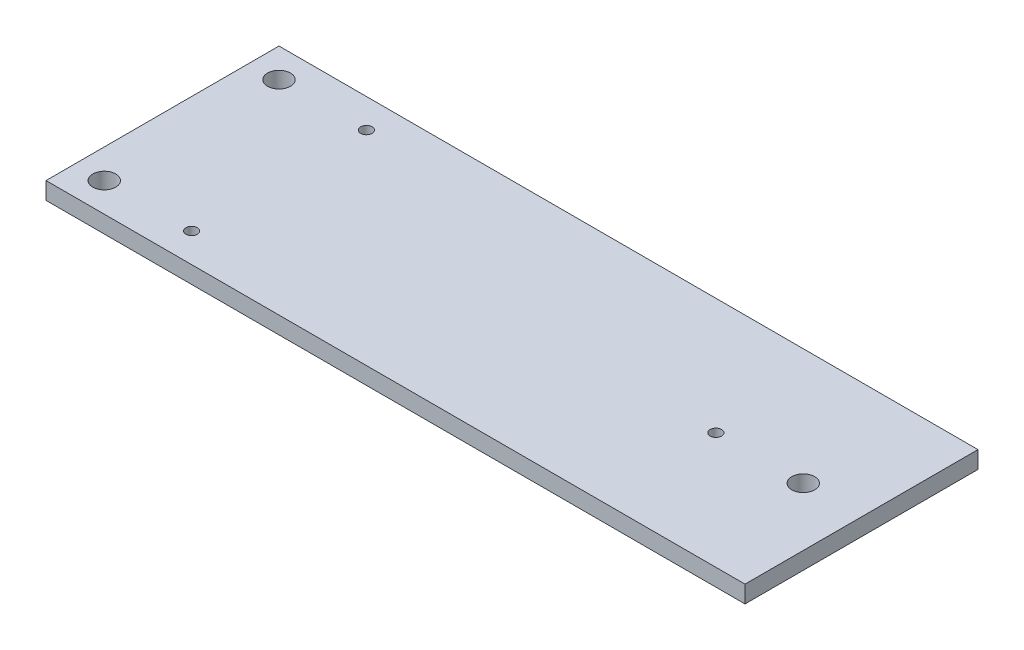
ISO-10303-21;
HEADER;
FILE_DESCRIPTION(('STEP AP214'),'2;1');
FILE_NAME('part.step','',(''),(''),'','','');
FILE_SCHEMA(('AUTOMOTIVE_DESIGN { 1 0 10303 214 1 1 1 1 }'));
ENDSEC;
DATA;
#1=APPLICATION_CONTEXT('core data for automotive mechanical design processes');
#2=APPLICATION_PROTOCOL_DEFINITION('international standard','automotive_design',2000,#1);
#3=PRODUCT_CONTEXT('',#1,'mechanical');
#4=PRODUCT('Part','Part','',(#3));
#5=PRODUCT_RELATED_PRODUCT_CATEGORY('part','',(#4));
#6=PRODUCT_DEFINITION_FORMATION('','',#4);
#7=PRODUCT_DEFINITION_CONTEXT('part definition',#1,'design');
#8=PRODUCT_DEFINITION('design','',#6,#7);
#9=PRODUCT_DEFINITION_SHAPE('','',#8);
#10=(LENGTH_UNIT() NAMED_UNIT(*) SI_UNIT(.MILLI.,.METRE.));
#11=(NAMED_UNIT(*) PLANE_ANGLE_UNIT() SI_UNIT($,.RADIAN.));
#12=(NAMED_UNIT(*) SI_UNIT($,.STERADIAN.) SOLID_ANGLE_UNIT());
#13=UNCERTAINTY_MEASURE_WITH_UNIT(LENGTH_MEASURE(1.E-05),#10,'distance_accuracy_value','');
#14=(GEOMETRIC_REPRESENTATION_CONTEXT(3) GLOBAL_UNCERTAINTY_ASSIGNED_CONTEXT((#13)) GLOBAL_UNIT_ASSIGNED_CONTEXT((#10,
#11,#12)) REPRESENTATION_CONTEXT('',''));
#15=CARTESIAN_POINT('',(0.,0.,0.));
#16=DIRECTION('',(0.,0.,1.));
#17=DIRECTION('',(1.,0.,0.));
#18=AXIS2_PLACEMENT_3D('',#15,#16,#17);
#19=CARTESIAN_POINT('',(0.,1.5,0.));
#20=DIRECTION('',(0.,-1.,0.));
#21=DIRECTION('',(0.,0.,-1.));
#22=AXIS2_PLACEMENT_3D('',#19,#20,#21);
#23=PLANE('',#22);
#24=CARTESIAN_POINT('',(48.26,1.5,-10.16));
#25=DIRECTION('',(0.,1.,0.));
#26=DIRECTION('',(0.,0.,1.));
#27=AXIS2_PLACEMENT_3D('',#24,#25,#26);
#28=CIRCLE('',#27,0.499999999999999);
#29=CARTESIAN_POINT('',(48.26,1.5,-9.66));
#30=VERTEX_POINT('',#29);
#31=EDGE_CURVE('E133',#30,#30,#28,.T.);
#32=ORIENTED_EDGE('',*,*,#31,.F.);
#33=EDGE_LOOP('',(#32));
#34=FACE_BOUND('',#33,.T.);
#35=CARTESIAN_POINT('',(2.54,1.5,-17.78));
#36=DIRECTION('',(0.,1.,0.));
#37=DIRECTION('',(0.,0.,-1.));
#38=AXIS2_PLACEMENT_3D('',#35,#36,#37);
#39=CIRCLE('',#38,0.999999999999999);
#40=CARTESIAN_POINT('',(2.54,1.5,-18.78));
#41=VERTEX_POINT('',#40);
#42=EDGE_CURVE('E121',#41,#41,#39,.T.);
#43=ORIENTED_EDGE('',*,*,#42,.F.);
#44=EDGE_LOOP('',(#43));
#45=FACE_BOUND('',#44,.T.);
#46=CARTESIAN_POINT('',(2.54,1.5,-2.54));
#47=DIRECTION('',(0.,1.,0.));
#48=DIRECTION('',(0.,0.,1.));
#49=AXIS2_PLACEMENT_3D('',#46,#47,#48);
#50=CIRCLE('',#49,1.);
#51=CARTESIAN_POINT('',(2.54,1.5,-1.54));
#52=VERTEX_POINT('',#51);
#53=EDGE_CURVE('E100',#52,#52,#50,.T.);
#54=ORIENTED_EDGE('',*,*,#53,.F.);
#55=EDGE_LOOP('',(#54));
#56=FACE_BOUND('',#55,.T.);
#57=DIRECTION('',(0.,0.,1.));
#58=VECTOR('',#57,1.);
#59=CARTESIAN_POINT('',(0.,1.5,0.));
#60=LINE('',#59,#58);
#61=CARTESIAN_POINT('',(0.,1.5,-20.32));
#62=VERTEX_POINT('',#61);
#63=CARTESIAN_POINT('',(0.,1.5,0.));
#64=VERTEX_POINT('',#63);
#65=EDGE_CURVE('E85',#62,#64,#60,.T.);
#66=ORIENTED_EDGE('',*,*,#65,.T.);
#67=DIRECTION('',(1.,0.,0.));
#68=VECTOR('',#67,1.);
#69=CARTESIAN_POINT('',(0.,1.5,0.));
#70=LINE('',#69,#68);
#71=CARTESIAN_POINT('',(60.96,1.5,0.));
#72=VERTEX_POINT('',#71);
#73=EDGE_CURVE('E80',#64,#72,#70,.T.);
#74=ORIENTED_EDGE('',*,*,#73,.T.);
#75=DIRECTION('',(0.,0.,-1.));
#76=VECTOR('',#75,1.);
#77=CARTESIAN_POINT('',(60.96,1.5,0.));
#78=LINE('',#77,#76);
#79=CARTESIAN_POINT('',(60.96,1.5,-20.32));
#80=VERTEX_POINT('',#79);
#81=EDGE_CURVE('E83',#72,#80,#78,.T.);
#82=ORIENTED_EDGE('',*,*,#81,.T.);
#83=DIRECTION('',(-1.,0.,0.));
#84=VECTOR('',#83,1.);
#85=CARTESIAN_POINT('',(0.,1.5,-20.32));
#86=LINE('',#85,#84);
#87=EDGE_CURVE('E50',#80,#62,#86,.T.);
#88=ORIENTED_EDGE('',*,*,#87,.T.);
#89=EDGE_LOOP('',(#66,#74,#82,#88));
#90=FACE_BOUND('',#89,.T.);
#91=CARTESIAN_POINT('',(55.88,1.5,-10.16));
#92=DIRECTION('',(0.,1.,0.));
#93=DIRECTION('',(0.,0.,1.));
#94=AXIS2_PLACEMENT_3D('',#91,#92,#93);
#95=CIRCLE('',#94,0.999999999999998);
#96=CARTESIAN_POINT('',(55.88,1.5,-9.16));
#97=VERTEX_POINT('',#96);
#98=EDGE_CURVE('E115',#97,#97,#95,.T.);
#99=ORIENTED_EDGE('',*,*,#98,.F.);
#100=EDGE_LOOP('',(#99));
#101=FACE_BOUND('',#100,.T.);
#102=CARTESIAN_POINT('',(10.16,1.5,-2.54));
#103=DIRECTION('',(0.,1.,0.));
#104=DIRECTION('',(0.,0.,1.));
#105=AXIS2_PLACEMENT_3D('',#102,#103,#104);
#106=CIRCLE('',#105,0.500000000000001);
#107=CARTESIAN_POINT('',(10.16,1.5,-2.04));
#108=VERTEX_POINT('',#107);
#109=EDGE_CURVE('E127',#108,#108,#106,.T.);
#110=ORIENTED_EDGE('',*,*,#109,.F.);
#111=EDGE_LOOP('',(#110));
#112=FACE_BOUND('',#111,.T.);
#113=CARTESIAN_POINT('',(10.16,1.5,-17.78));
#114=DIRECTION('',(0.,1.,0.));
#115=DIRECTION('',(0.,0.,-1.));
#116=AXIS2_PLACEMENT_3D('',#113,#114,#115);
#117=CIRCLE('',#116,0.500000000000001);
#118=CARTESIAN_POINT('',(10.16,1.5,-18.28));
#119=VERTEX_POINT('',#118);
#120=EDGE_CURVE('E139',#119,#119,#117,.T.);
#121=ORIENTED_EDGE('',*,*,#120,.F.);
#122=EDGE_LOOP('',(#121));
#123=FACE_BOUND('',#122,.T.);
#124=ADVANCED_FACE('F33',(#34,#45,#56,#90,#101,#112,#123),#23,.F.);
#125=CARTESIAN_POINT('',(0.,0.,0.));
#126=DIRECTION('',(0.,-1.,0.));
#127=DIRECTION('',(0.,0.,-1.));
#128=AXIS2_PLACEMENT_3D('',#125,#126,#127);
#129=PLANE('',#128);
#130=CARTESIAN_POINT('',(48.26,0.,-10.16));
#131=DIRECTION('',(0.,1.,0.));
#132=DIRECTION('',(0.,0.,1.));
#133=AXIS2_PLACEMENT_3D('',#130,#131,#132);
#134=CIRCLE('',#133,0.499999999999999);
#135=CARTESIAN_POINT('',(48.26,0.,-9.66));
#136=VERTEX_POINT('',#135);
#137=EDGE_CURVE('E136',#136,#136,#134,.T.);
#138=ORIENTED_EDGE('',*,*,#137,.T.);
#139=EDGE_LOOP('',(#138));
#140=FACE_BOUND('',#139,.T.);
#141=CARTESIAN_POINT('',(2.54,0.,-17.78));
#142=DIRECTION('',(0.,1.,0.));
#143=DIRECTION('',(0.,0.,-1.));
#144=AXIS2_PLACEMENT_3D('',#141,#142,#143);
#145=CIRCLE('',#144,0.999999999999999);
#146=CARTESIAN_POINT('',(2.54,0.,-18.78));
#147=VERTEX_POINT('',#146);
#148=EDGE_CURVE('E124',#147,#147,#145,.T.);
#149=ORIENTED_EDGE('',*,*,#148,.T.);
#150=EDGE_LOOP('',(#149));
#151=FACE_BOUND('',#150,.T.);
#152=CARTESIAN_POINT('',(2.54,0.,-2.54));
#153=DIRECTION('',(0.,1.,0.));
#154=DIRECTION('',(0.,0.,1.));
#155=AXIS2_PLACEMENT_3D('',#152,#153,#154);
#156=CIRCLE('',#155,1.);
#157=CARTESIAN_POINT('',(2.54,0.,-1.54));
#158=VERTEX_POINT('',#157);
#159=EDGE_CURVE('E112',#158,#158,#156,.T.);
#160=ORIENTED_EDGE('',*,*,#159,.T.);
#161=EDGE_LOOP('',(#160));
#162=FACE_BOUND('',#161,.T.);
#163=DIRECTION('',(0.,0.,1.));
#164=VECTOR('',#163,1.);
#165=CARTESIAN_POINT('',(0.,0.,0.));
#166=LINE('',#165,#164);
#167=CARTESIAN_POINT('',(0.,0.,-20.32));
#168=VERTEX_POINT('',#167);
#169=CARTESIAN_POINT('',(0.,0.,0.));
#170=VERTEX_POINT('',#169);
#171=EDGE_CURVE('E97',#168,#170,#166,.T.);
#172=ORIENTED_EDGE('',*,*,#171,.F.);
#173=DIRECTION('',(-1.,0.,0.));
#174=VECTOR('',#173,1.);
#175=CARTESIAN_POINT('',(0.,0.,-20.32));
#176=LINE('',#175,#174);
#177=CARTESIAN_POINT('',(60.96,0.,-20.32));
#178=VERTEX_POINT('',#177);
#179=EDGE_CURVE('E73',#178,#168,#176,.T.);
#180=ORIENTED_EDGE('',*,*,#179,.F.);
#181=DIRECTION('',(0.,0.,-1.));
#182=VECTOR('',#181,1.);
#183=CARTESIAN_POINT('',(60.96,0.,0.));
#184=LINE('',#183,#182);
#185=CARTESIAN_POINT('',(60.96,0.,0.));
#186=VERTEX_POINT('',#185);
#187=EDGE_CURVE('E67',#186,#178,#184,.T.);
#188=ORIENTED_EDGE('',*,*,#187,.F.);
#189=DIRECTION('',(1.,0.,0.));
#190=VECTOR('',#189,1.);
#191=CARTESIAN_POINT('',(0.,0.,0.));
#192=LINE('',#191,#190);
#193=EDGE_CURVE('E89',#170,#186,#192,.T.);
#194=ORIENTED_EDGE('',*,*,#193,.F.);
#195=EDGE_LOOP('',(#172,#180,#188,#194));
#196=FACE_BOUND('',#195,.T.);
#197=CARTESIAN_POINT('',(55.88,0.,-10.16));
#198=DIRECTION('',(0.,1.,0.));
#199=DIRECTION('',(0.,0.,1.));
#200=AXIS2_PLACEMENT_3D('',#197,#198,#199);
#201=CIRCLE('',#200,0.999999999999998);
#202=CARTESIAN_POINT('',(55.88,0.,-9.16));
#203=VERTEX_POINT('',#202);
#204=EDGE_CURVE('E118',#203,#203,#201,.T.);
#205=ORIENTED_EDGE('',*,*,#204,.T.);
#206=EDGE_LOOP('',(#205));
#207=FACE_BOUND('',#206,.T.);
#208=CARTESIAN_POINT('',(10.16,0.,-2.54));
#209=DIRECTION('',(0.,1.,0.));
#210=DIRECTION('',(0.,0.,1.));
#211=AXIS2_PLACEMENT_3D('',#208,#209,#210);
#212=CIRCLE('',#211,0.500000000000001);
#213=CARTESIAN_POINT('',(10.16,0.,-2.04));
#214=VERTEX_POINT('',#213);
#215=EDGE_CURVE('E130',#214,#214,#212,.T.);
#216=ORIENTED_EDGE('',*,*,#215,.T.);
#217=EDGE_LOOP('',(#216));
#218=FACE_BOUND('',#217,.T.);
#219=CARTESIAN_POINT('',(10.16,0.,-17.78));
#220=DIRECTION('',(0.,1.,0.));
#221=DIRECTION('',(0.,0.,-1.));
#222=AXIS2_PLACEMENT_3D('',#219,#220,#221);
#223=CIRCLE('',#222,0.500000000000001);
#224=CARTESIAN_POINT('',(10.16,0.,-18.28));
#225=VERTEX_POINT('',#224);
#226=EDGE_CURVE('E142',#225,#225,#223,.T.);
#227=ORIENTED_EDGE('',*,*,#226,.T.);
#228=EDGE_LOOP('',(#227));
#229=FACE_BOUND('',#228,.T.);
#230=ADVANCED_FACE('F108',(#140,#151,#162,#196,#207,#218,#229),#129,.T.);
#231=CARTESIAN_POINT('',(0.,1.5,0.));
#232=DIRECTION('',(1.,0.,0.));
#233=DIRECTION('',(0.,0.,-1.));
#234=AXIS2_PLACEMENT_3D('',#231,#232,#233);
#235=PLANE('',#234);
#236=ORIENTED_EDGE('',*,*,#171,.T.);
#237=DIRECTION('',(0.,-1.,0.));
#238=VECTOR('',#237,1.);
#239=CARTESIAN_POINT('',(0.,1.5,0.));
#240=LINE('',#239,#238);
#241=EDGE_CURVE('E11',#64,#170,#240,.T.);
#242=ORIENTED_EDGE('',*,*,#241,.F.);
#243=ORIENTED_EDGE('',*,*,#65,.F.);
#244=DIRECTION('',(0.,-1.,0.));
#245=VECTOR('',#244,1.);
#246=CARTESIAN_POINT('',(0.,1.5,-20.32));
#247=LINE('',#246,#245);
#248=EDGE_CURVE('E93',#62,#168,#247,.T.);
#249=ORIENTED_EDGE('',*,*,#248,.T.);
#250=EDGE_LOOP('',(#236,#242,#243,#249));
#251=FACE_BOUND('',#250,.T.);
#252=ADVANCED_FACE('F35',(#251),#235,.F.);
#253=CARTESIAN_POINT('',(0.,1.5,0.));
#254=DIRECTION('',(0.,0.,-1.));
#255=DIRECTION('',(-1.,0.,0.));
#256=AXIS2_PLACEMENT_3D('',#253,#254,#255);
#257=PLANE('',#256);
#258=ORIENTED_EDGE('',*,*,#193,.T.);
#259=DIRECTION('',(0.,-1.,0.));
#260=VECTOR('',#259,1.);
#261=CARTESIAN_POINT('',(60.96,1.5,0.));
#262=LINE('',#261,#260);
#263=EDGE_CURVE('E42',#72,#186,#262,.T.);
#264=ORIENTED_EDGE('',*,*,#263,.F.);
#265=ORIENTED_EDGE('',*,*,#73,.F.);
#266=ORIENTED_EDGE('',*,*,#241,.T.);
#267=EDGE_LOOP('',(#258,#264,#265,#266));
#268=FACE_BOUND('',#267,.T.);
#269=ADVANCED_FACE('F88',(#268),#257,.F.);
#270=CARTESIAN_POINT('',(60.96,1.5,0.));
#271=DIRECTION('',(-1.,0.,0.));
#272=DIRECTION('',(0.,0.,1.));
#273=AXIS2_PLACEMENT_3D('',#270,#271,#272);
#274=PLANE('',#273);
#275=ORIENTED_EDGE('',*,*,#187,.T.);
#276=DIRECTION('',(0.,-1.,0.));
#277=VECTOR('',#276,1.);
#278=CARTESIAN_POINT('',(60.96,1.5,-20.32));
#279=LINE('',#278,#277);
#280=EDGE_CURVE('E90',#80,#178,#279,.T.);
#281=ORIENTED_EDGE('',*,*,#280,.F.);
#282=ORIENTED_EDGE('',*,*,#81,.F.);
#283=ORIENTED_EDGE('',*,*,#263,.T.);
#284=EDGE_LOOP('',(#275,#281,#282,#283));
#285=FACE_BOUND('',#284,.T.);
#286=ADVANCED_FACE('F91',(#285),#274,.F.);
#287=CARTESIAN_POINT('',(0.,1.5,-20.32));
#288=DIRECTION('',(0.,0.,1.));
#289=DIRECTION('',(1.,0.,0.));
#290=AXIS2_PLACEMENT_3D('',#287,#288,#289);
#291=PLANE('',#290);
#292=ORIENTED_EDGE('',*,*,#179,.T.);
#293=ORIENTED_EDGE('',*,*,#248,.F.);
#294=ORIENTED_EDGE('',*,*,#87,.F.);
#295=ORIENTED_EDGE('',*,*,#280,.T.);
#296=EDGE_LOOP('',(#292,#293,#294,#295));
#297=FACE_BOUND('',#296,.T.);
#298=ADVANCED_FACE('F105',(#297),#291,.F.);
#299=CARTESIAN_POINT('',(2.54,1.5,-2.54));
#300=DIRECTION('',(0.,-1.,0.));
#301=DIRECTION('',(0.,0.,-1.));
#302=AXIS2_PLACEMENT_3D('',#299,#300,#301);
#303=CYLINDRICAL_SURFACE('',#302,1.);
#304=ORIENTED_EDGE('',*,*,#53,.T.);
#305=EDGE_LOOP('',(#304));
#306=FACE_BOUND('',#305,.T.);
#307=ORIENTED_EDGE('',*,*,#159,.F.);
#308=EDGE_LOOP('',(#307));
#309=FACE_BOUND('',#308,.T.);
#310=ADVANCED_FACE('F162',(#306,#309),#303,.F.);
#311=CARTESIAN_POINT('',(55.88,1.5,-10.16));
#312=DIRECTION('',(0.,-1.,0.));
#313=DIRECTION('',(0.,0.,-1.));
#314=AXIS2_PLACEMENT_3D('',#311,#312,#313);
#315=CYLINDRICAL_SURFACE('',#314,0.999999999999998);
#316=ORIENTED_EDGE('',*,*,#98,.T.);
#317=EDGE_LOOP('',(#316));
#318=FACE_BOUND('',#317,.T.);
#319=ORIENTED_EDGE('',*,*,#204,.F.);
#320=EDGE_LOOP('',(#319));
#321=FACE_BOUND('',#320,.T.);
#322=ADVANCED_FACE('F208',(#318,#321),#315,.F.);
#323=CARTESIAN_POINT('',(2.54,1.5,-17.78));
#324=DIRECTION('',(0.,-1.,0.));
#325=DIRECTION('',(0.,0.,-1.));
#326=AXIS2_PLACEMENT_3D('',#323,#324,#325);
#327=CYLINDRICAL_SURFACE('',#326,0.999999999999999);
#328=ORIENTED_EDGE('',*,*,#42,.T.);
#329=EDGE_LOOP('',(#328));
#330=FACE_BOUND('',#329,.T.);
#331=ORIENTED_EDGE('',*,*,#148,.F.);
#332=EDGE_LOOP('',(#331));
#333=FACE_BOUND('',#332,.T.);
#334=ADVANCED_FACE('F216',(#330,#333),#327,.F.);
#335=CARTESIAN_POINT('',(10.16,1.5,-2.54));
#336=DIRECTION('',(0.,-1.,0.));
#337=DIRECTION('',(0.,0.,-1.));
#338=AXIS2_PLACEMENT_3D('',#335,#336,#337);
#339=CYLINDRICAL_SURFACE('',#338,0.500000000000001);
#340=ORIENTED_EDGE('',*,*,#109,.T.);
#341=EDGE_LOOP('',(#340));
#342=FACE_BOUND('',#341,.T.);
#343=ORIENTED_EDGE('',*,*,#215,.F.);
#344=EDGE_LOOP('',(#343));
#345=FACE_BOUND('',#344,.T.);
#346=ADVANCED_FACE('F224',(#342,#345),#339,.F.);
#347=CARTESIAN_POINT('',(48.26,1.5,-10.16));
#348=DIRECTION('',(0.,-1.,0.));
#349=DIRECTION('',(0.,0.,-1.));
#350=AXIS2_PLACEMENT_3D('',#347,#348,#349);
#351=CYLINDRICAL_SURFACE('',#350,0.499999999999999);
#352=ORIENTED_EDGE('',*,*,#31,.T.);
#353=EDGE_LOOP('',(#352));
#354=FACE_BOUND('',#353,.T.);
#355=ORIENTED_EDGE('',*,*,#137,.F.);
#356=EDGE_LOOP('',(#355));
#357=FACE_BOUND('',#356,.T.);
#358=ADVANCED_FACE('F233',(#354,#357),#351,.F.);
#359=CARTESIAN_POINT('',(10.16,1.5,-17.78));
#360=DIRECTION('',(0.,-1.,0.));
#361=DIRECTION('',(0.,0.,-1.));
#362=AXIS2_PLACEMENT_3D('',#359,#360,#361);
#363=CYLINDRICAL_SURFACE('',#362,0.500000000000001);
#364=ORIENTED_EDGE('',*,*,#120,.T.);
#365=EDGE_LOOP('',(#364));
#366=FACE_BOUND('',#365,.T.);
#367=ORIENTED_EDGE('',*,*,#226,.F.);
#368=EDGE_LOOP('',(#367));
#369=FACE_BOUND('',#368,.T.);
#370=ADVANCED_FACE('F148',(#366,#369),#363,.F.);
#371=CLOSED_SHELL('',(#124,#230,#252,#269,#286,#298,#310,#322,#334,#346,#358,#370));
#372=MANIFOLD_SOLID_BREP('B2',#371);
#373=ADVANCED_BREP_SHAPE_REPRESENTATION('',(#18,#372),#14);
#374=SHAPE_DEFINITION_REPRESENTATION(#9,#373);
ENDSEC;
END-ISO-10303-21;
